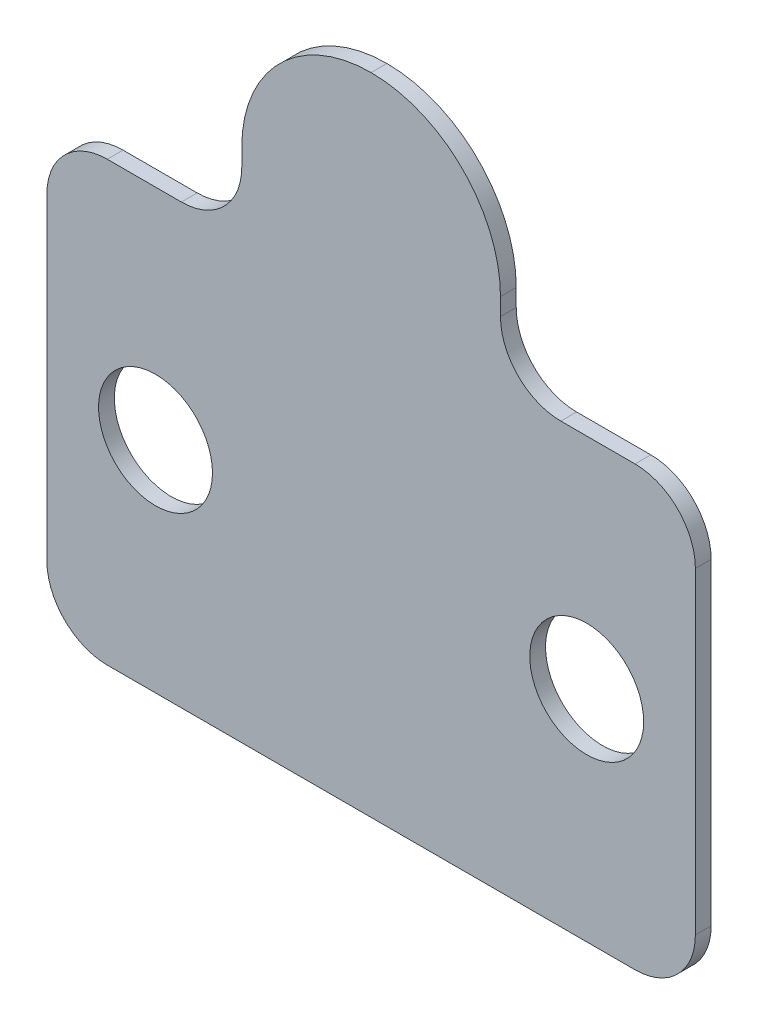
ISO-10303-21;
HEADER;
FILE_DESCRIPTION(('STEP AP214'),'2;1');
FILE_NAME('part.step','',(''),(''),'','','');
FILE_SCHEMA(('AUTOMOTIVE_DESIGN { 1 0 10303 214 1 1 1 1 }'));
ENDSEC;
DATA;
#1=APPLICATION_CONTEXT('core data for automotive mechanical design processes');
#2=APPLICATION_PROTOCOL_DEFINITION('international standard','automotive_design',2000,#1);
#3=PRODUCT_CONTEXT('',#1,'mechanical');
#4=PRODUCT('Part','Part','',(#3));
#5=PRODUCT_RELATED_PRODUCT_CATEGORY('part','',(#4));
#6=PRODUCT_DEFINITION_FORMATION('','',#4);
#7=PRODUCT_DEFINITION_CONTEXT('part definition',#1,'design');
#8=PRODUCT_DEFINITION('design','',#6,#7);
#9=PRODUCT_DEFINITION_SHAPE('','',#8);
#10=(LENGTH_UNIT() NAMED_UNIT(*) SI_UNIT(.MILLI.,.METRE.));
#11=(NAMED_UNIT(*) PLANE_ANGLE_UNIT() SI_UNIT($,.RADIAN.));
#12=(NAMED_UNIT(*) SI_UNIT($,.STERADIAN.) SOLID_ANGLE_UNIT());
#13=UNCERTAINTY_MEASURE_WITH_UNIT(LENGTH_MEASURE(1.E-05),#10,'distance_accuracy_value','');
#14=(GEOMETRIC_REPRESENTATION_CONTEXT(3) GLOBAL_UNCERTAINTY_ASSIGNED_CONTEXT((#13)) GLOBAL_UNIT_ASSIGNED_CONTEXT((#10,
#11,#12)) REPRESENTATION_CONTEXT('',''));
#15=CARTESIAN_POINT('',(0.,0.,0.));
#16=DIRECTION('',(0.,0.,1.));
#17=DIRECTION('',(1.,0.,0.));
#18=AXIS2_PLACEMENT_3D('',#15,#16,#17);
#19=CARTESIAN_POINT('',(0.,25.4,0.9144));
#20=DIRECTION('',(0.,1.,0.));
#21=DIRECTION('',(-1.,0.,0.));
#22=AXIS2_PLACEMENT_3D('',#19,#20,#21);
#23=PLANE('',#22);
#24=DIRECTION('',(1.,0.,0.));
#25=VECTOR('',#24,1.);
#26=CARTESIAN_POINT('',(0.,25.4,0.));
#27=LINE('',#26,#25);
#28=CARTESIAN_POINT('',(29.8,25.4,0.));
#29=VERTEX_POINT('',#28);
#30=CARTESIAN_POINT('',(34.1,25.4,0.));
#31=VERTEX_POINT('',#30);
#32=EDGE_CURVE('E359',#29,#31,#27,.T.);
#33=ORIENTED_EDGE('',*,*,#32,.F.);
#34=DIRECTION('',(0.,0.,-1.));
#35=VECTOR('',#34,1.);
#36=CARTESIAN_POINT('',(29.8,25.4,0.9144));
#37=LINE('',#36,#35);
#38=CARTESIAN_POINT('',(29.8,25.4,0.9144));
#39=VERTEX_POINT('',#38);
#40=EDGE_CURVE('E277',#29,#39,#37,.F.);
#41=ORIENTED_EDGE('',*,*,#40,.T.);
#42=DIRECTION('',(1.,0.,0.));
#43=VECTOR('',#42,1.);
#44=CARTESIAN_POINT('',(0.,25.4,0.9144));
#45=LINE('',#44,#43);
#46=CARTESIAN_POINT('',(34.1,25.4,0.9144));
#47=VERTEX_POINT('',#46);
#48=EDGE_CURVE('E440',#39,#47,#45,.T.);
#49=ORIENTED_EDGE('',*,*,#48,.T.);
#50=DIRECTION('',(0.,0.,-1.));
#51=VECTOR('',#50,1.);
#52=CARTESIAN_POINT('',(34.1,25.4,0.));
#53=LINE('',#52,#51);
#54=EDGE_CURVE('E273',#47,#31,#53,.T.);
#55=ORIENTED_EDGE('',*,*,#54,.T.);
#56=EDGE_LOOP('',(#33,#41,#49,#55));
#57=FACE_BOUND('',#56,.T.);
#58=ADVANCED_FACE('F45',(#57),#23,.T.);
#59=CARTESIAN_POINT('',(26.3,0.,0.9144));
#60=DIRECTION('',(1.,0.,0.));
#61=DIRECTION('',(0.,0.,-1.));
#62=AXIS2_PLACEMENT_3D('',#59,#60,#61);
#63=PLANE('',#62);
#64=DIRECTION('',(0.,-1.,0.));
#65=VECTOR('',#64,1.);
#66=CARTESIAN_POINT('',(26.3,0.,0.9144));
#67=LINE('',#66,#65);
#68=CARTESIAN_POINT('',(26.3,29.9,0.9144));
#69=VERTEX_POINT('',#68);
#70=CARTESIAN_POINT('',(26.3,28.9,0.9144));
#71=VERTEX_POINT('',#70);
#72=EDGE_CURVE('E345',#69,#71,#67,.T.);
#73=ORIENTED_EDGE('',*,*,#72,.T.);
#74=DIRECTION('',(0.,0.,-1.));
#75=VECTOR('',#74,1.);
#76=CARTESIAN_POINT('',(26.3,28.9,0.));
#77=LINE('',#76,#75);
#78=CARTESIAN_POINT('',(26.3,28.9,0.));
#79=VERTEX_POINT('',#78);
#80=EDGE_CURVE('E269',#71,#79,#77,.T.);
#81=ORIENTED_EDGE('',*,*,#80,.T.);
#82=DIRECTION('',(0.,-1.,0.));
#83=VECTOR('',#82,1.);
#84=CARTESIAN_POINT('',(26.3,0.,0.));
#85=LINE('',#84,#83);
#86=CARTESIAN_POINT('',(26.3,29.9,0.));
#87=VERTEX_POINT('',#86);
#88=EDGE_CURVE('E324',#87,#79,#85,.T.);
#89=ORIENTED_EDGE('',*,*,#88,.F.);
#90=DIRECTION('',(0.,0.,-1.));
#91=VECTOR('',#90,1.);
#92=CARTESIAN_POINT('',(26.3,29.9,0.9144));
#93=LINE('',#92,#91);
#94=EDGE_CURVE('E265',#87,#69,#93,.F.);
#95=ORIENTED_EDGE('',*,*,#94,.T.);
#96=EDGE_LOOP('',(#73,#81,#89,#95));
#97=FACE_BOUND('',#96,.T.);
#98=ADVANCED_FACE('F390',(#97),#63,.T.);
#99=CARTESIAN_POINT('',(11.3,0.,0.9144));
#100=DIRECTION('',(-1.,0.,0.));
#101=DIRECTION('',(0.,0.,1.));
#102=AXIS2_PLACEMENT_3D('',#99,#100,#101);
#103=PLANE('',#102);
#104=DIRECTION('',(0.,1.,0.));
#105=VECTOR('',#104,1.);
#106=CARTESIAN_POINT('',(11.3,0.,0.));
#107=LINE('',#106,#105);
#108=CARTESIAN_POINT('',(11.3,28.9,0.));
#109=VERTEX_POINT('',#108);
#110=CARTESIAN_POINT('',(11.3,29.9,0.));
#111=VERTEX_POINT('',#110);
#112=EDGE_CURVE('E311',#109,#111,#107,.T.);
#113=ORIENTED_EDGE('',*,*,#112,.F.);
#114=DIRECTION('',(0.,0.,-1.));
#115=VECTOR('',#114,1.);
#116=CARTESIAN_POINT('',(11.3,28.9,0.9144));
#117=LINE('',#116,#115);
#118=CARTESIAN_POINT('',(11.3,28.9,0.9144));
#119=VERTEX_POINT('',#118);
#120=EDGE_CURVE('E296',#109,#119,#117,.F.);
#121=ORIENTED_EDGE('',*,*,#120,.T.);
#122=DIRECTION('',(0.,1.,0.));
#123=VECTOR('',#122,1.);
#124=CARTESIAN_POINT('',(11.3,0.,0.9144));
#125=LINE('',#124,#123);
#126=CARTESIAN_POINT('',(11.3,29.9,0.9144));
#127=VERTEX_POINT('',#126);
#128=EDGE_CURVE('E332',#119,#127,#125,.T.);
#129=ORIENTED_EDGE('',*,*,#128,.T.);
#130=DIRECTION('',(0.,0.,-1.));
#131=VECTOR('',#130,1.);
#132=CARTESIAN_POINT('',(11.3,29.9,0.9144));
#133=LINE('',#132,#131);
#134=EDGE_CURVE('E293',#127,#111,#133,.T.);
#135=ORIENTED_EDGE('',*,*,#134,.T.);
#136=EDGE_LOOP('',(#113,#121,#129,#135));
#137=FACE_BOUND('',#136,.T.);
#138=ADVANCED_FACE('F319',(#137),#103,.T.);
#139=CARTESIAN_POINT('',(0.,25.4,0.9144));
#140=DIRECTION('',(0.,1.,0.));
#141=DIRECTION('',(0.,0.,1.));
#142=AXIS2_PLACEMENT_3D('',#139,#140,#141);
#143=PLANE('',#142);
#144=DIRECTION('',(1.,0.,0.));
#145=VECTOR('',#144,1.);
#146=CARTESIAN_POINT('',(0.,25.4,0.));
#147=LINE('',#146,#145);
#148=CARTESIAN_POINT('',(3.5,25.4,0.));
#149=VERTEX_POINT('',#148);
#150=CARTESIAN_POINT('',(7.8,25.4,0.));
#151=VERTEX_POINT('',#150);
#152=EDGE_CURVE('E314',#149,#151,#147,.T.);
#153=ORIENTED_EDGE('',*,*,#152,.F.);
#154=DIRECTION('',(0.,0.,-1.));
#155=VECTOR('',#154,1.);
#156=CARTESIAN_POINT('',(3.5,25.4,0.9144));
#157=LINE('',#156,#155);
#158=CARTESIAN_POINT('',(3.5,25.4,0.9144));
#159=VERTEX_POINT('',#158);
#160=EDGE_CURVE('E290',#149,#159,#157,.F.);
#161=ORIENTED_EDGE('',*,*,#160,.T.);
#162=DIRECTION('',(1.,0.,0.));
#163=VECTOR('',#162,1.);
#164=CARTESIAN_POINT('',(0.,25.4,0.9144));
#165=LINE('',#164,#163);
#166=CARTESIAN_POINT('',(7.8,25.4,0.9144));
#167=VERTEX_POINT('',#166);
#168=EDGE_CURVE('E331',#159,#167,#165,.T.);
#169=ORIENTED_EDGE('',*,*,#168,.T.);
#170=DIRECTION('',(0.,0.,-1.));
#171=VECTOR('',#170,1.);
#172=CARTESIAN_POINT('',(7.8,25.4,0.));
#173=LINE('',#172,#171);
#174=EDGE_CURVE('E286',#167,#151,#173,.T.);
#175=ORIENTED_EDGE('',*,*,#174,.T.);
#176=EDGE_LOOP('',(#153,#161,#169,#175));
#177=FACE_BOUND('',#176,.T.);
#178=ADVANCED_FACE('F334',(#177),#143,.T.);
#179=CARTESIAN_POINT('',(0.,0.,0.9144));
#180=DIRECTION('',(-1.,0.,0.));
#181=DIRECTION('',(0.,0.,1.));
#182=AXIS2_PLACEMENT_3D('',#179,#180,#181);
#183=PLANE('',#182);
#184=DIRECTION('',(0.,1.,0.));
#185=VECTOR('',#184,1.);
#186=CARTESIAN_POINT('',(0.,0.,0.));
#187=LINE('',#186,#185);
#188=CARTESIAN_POINT('',(0.,3.5,0.));
#189=VERTEX_POINT('',#188);
#190=CARTESIAN_POINT('',(0.,21.9,0.));
#191=VERTEX_POINT('',#190);
#192=EDGE_CURVE('E225',#189,#191,#187,.T.);
#193=ORIENTED_EDGE('',*,*,#192,.F.);
#194=DIRECTION('',(0.,0.,-1.));
#195=VECTOR('',#194,1.);
#196=CARTESIAN_POINT('',(0.,3.5,0.9144));
#197=LINE('',#196,#195);
#198=CARTESIAN_POINT('',(0.,3.5,0.9144));
#199=VERTEX_POINT('',#198);
#200=EDGE_CURVE('E74',#189,#199,#197,.F.);
#201=ORIENTED_EDGE('',*,*,#200,.T.);
#202=DIRECTION('',(0.,1.,0.));
#203=VECTOR('',#202,1.);
#204=CARTESIAN_POINT('',(0.,0.,0.9144));
#205=LINE('',#204,#203);
#206=CARTESIAN_POINT('',(0.,21.9,0.9144));
#207=VERTEX_POINT('',#206);
#208=EDGE_CURVE('E337',#199,#207,#205,.T.);
#209=ORIENTED_EDGE('',*,*,#208,.T.);
#210=DIRECTION('',(0.,0.,-1.));
#211=VECTOR('',#210,1.);
#212=CARTESIAN_POINT('',(0.,21.9,0.9144));
#213=LINE('',#212,#211);
#214=EDGE_CURVE('E280',#207,#191,#213,.T.);
#215=ORIENTED_EDGE('',*,*,#214,.T.);
#216=EDGE_LOOP('',(#193,#201,#209,#215));
#217=FACE_BOUND('',#216,.T.);
#218=ADVANCED_FACE('F368',(#217),#183,.T.);
#219=CARTESIAN_POINT('',(0.,0.,0.9144));
#220=DIRECTION('',(0.,1.,0.));
#221=DIRECTION('',(0.,0.,1.));
#222=AXIS2_PLACEMENT_3D('',#219,#220,#221);
#223=PLANE('',#222);
#224=DIRECTION('',(1.,0.,0.));
#225=VECTOR('',#224,1.);
#226=CARTESIAN_POINT('',(0.,0.,0.));
#227=LINE('',#226,#225);
#228=CARTESIAN_POINT('',(3.5,0.,0.));
#229=VERTEX_POINT('',#228);
#230=CARTESIAN_POINT('',(34.1,0.,0.));
#231=VERTEX_POINT('',#230);
#232=EDGE_CURVE('E215',#229,#231,#227,.T.);
#233=ORIENTED_EDGE('',*,*,#232,.T.);
#234=DIRECTION('',(0.,0.,-1.));
#235=VECTOR('',#234,1.);
#236=CARTESIAN_POINT('',(34.1,0.,0.9144));
#237=LINE('',#236,#235);
#238=CARTESIAN_POINT('',(34.1,0.,0.9144));
#239=VERTEX_POINT('',#238);
#240=EDGE_CURVE('E190',#231,#239,#237,.F.);
#241=ORIENTED_EDGE('',*,*,#240,.T.);
#242=DIRECTION('',(1.,0.,0.));
#243=VECTOR('',#242,1.);
#244=CARTESIAN_POINT('',(0.,0.,0.9144));
#245=LINE('',#244,#243);
#246=CARTESIAN_POINT('',(3.5,0.,0.9144));
#247=VERTEX_POINT('',#246);
#248=EDGE_CURVE('E342',#247,#239,#245,.T.);
#249=ORIENTED_EDGE('',*,*,#248,.F.);
#250=DIRECTION('',(0.,0.,-1.));
#251=VECTOR('',#250,1.);
#252=CARTESIAN_POINT('',(3.5,0.,0.));
#253=LINE('',#252,#251);
#254=EDGE_CURVE('E196',#247,#229,#253,.T.);
#255=ORIENTED_EDGE('',*,*,#254,.T.);
#256=EDGE_LOOP('',(#233,#241,#249,#255));
#257=FACE_BOUND('',#256,.T.);
#258=ADVANCED_FACE('F376',(#257),#223,.F.);
#259=CARTESIAN_POINT('',(6.3,12.7,0.9144));
#260=DIRECTION('',(0.,0.,-1.));
#261=DIRECTION('',(-1.,0.,0.));
#262=AXIS2_PLACEMENT_3D('',#259,#260,#261);
#263=CYLINDRICAL_SURFACE('',#262,3.302);
#264=CARTESIAN_POINT('',(6.3,12.7,0.9144));
#265=DIRECTION('',(0.,0.,1.));
#266=DIRECTION('',(1.,0.,0.));
#267=AXIS2_PLACEMENT_3D('',#264,#265,#266);
#268=CIRCLE('',#267,3.302);
#269=CARTESIAN_POINT('',(9.602,12.7,0.9144));
#270=VERTEX_POINT('',#269);
#271=EDGE_CURVE('E222',#270,#270,#268,.T.);
#272=ORIENTED_EDGE('',*,*,#271,.T.);
#273=EDGE_LOOP('',(#272));
#274=FACE_BOUND('',#273,.T.);
#275=CARTESIAN_POINT('',(6.3,12.7,0.));
#276=DIRECTION('',(0.,0.,1.));
#277=DIRECTION('',(1.,0.,0.));
#278=AXIS2_PLACEMENT_3D('',#275,#276,#277);
#279=CIRCLE('',#278,3.302);
#280=CARTESIAN_POINT('',(9.602,12.7,0.));
#281=VERTEX_POINT('',#280);
#282=EDGE_CURVE('E355',#281,#281,#279,.T.);
#283=ORIENTED_EDGE('',*,*,#282,.F.);
#284=EDGE_LOOP('',(#283));
#285=FACE_BOUND('',#284,.T.);
#286=ADVANCED_FACE('F378',(#274,#285),#263,.F.);
#287=CARTESIAN_POINT('',(31.3,12.7,0.9144));
#288=DIRECTION('',(0.,0.,-1.));
#289=DIRECTION('',(-1.,0.,0.));
#290=AXIS2_PLACEMENT_3D('',#287,#288,#289);
#291=CYLINDRICAL_SURFACE('',#290,3.30199999999998);
#292=CARTESIAN_POINT('',(31.3,12.7,0.9144));
#293=DIRECTION('',(0.,0.,1.));
#294=DIRECTION('',(1.,0.,0.));
#295=AXIS2_PLACEMENT_3D('',#292,#293,#294);
#296=CIRCLE('',#295,3.30199999999998);
#297=CARTESIAN_POINT('',(34.602,12.7,0.9144));
#298=VERTEX_POINT('',#297);
#299=EDGE_CURVE('E214',#298,#298,#296,.T.);
#300=ORIENTED_EDGE('',*,*,#299,.T.);
#301=EDGE_LOOP('',(#300));
#302=FACE_BOUND('',#301,.T.);
#303=CARTESIAN_POINT('',(31.3,12.7,0.));
#304=DIRECTION('',(0.,0.,1.));
#305=DIRECTION('',(1.,0.,0.));
#306=AXIS2_PLACEMENT_3D('',#303,#304,#305);
#307=CIRCLE('',#306,3.30199999999998);
#308=CARTESIAN_POINT('',(34.602,12.7,0.));
#309=VERTEX_POINT('',#308);
#310=EDGE_CURVE('E352',#309,#309,#307,.T.);
#311=ORIENTED_EDGE('',*,*,#310,.F.);
#312=EDGE_LOOP('',(#311));
#313=FACE_BOUND('',#312,.T.);
#314=ADVANCED_FACE('F384',(#302,#313),#291,.F.);
#315=CARTESIAN_POINT('',(37.6,0.,0.9144));
#316=DIRECTION('',(-1.,0.,0.));
#317=DIRECTION('',(0.,0.,1.));
#318=AXIS2_PLACEMENT_3D('',#315,#316,#317);
#319=PLANE('',#318);
#320=DIRECTION('',(0.,1.,0.));
#321=VECTOR('',#320,1.);
#322=CARTESIAN_POINT('',(37.6,0.,0.9144));
#323=LINE('',#322,#321);
#324=CARTESIAN_POINT('',(37.6,3.5,0.9144));
#325=VERTEX_POINT('',#324);
#326=CARTESIAN_POINT('',(37.6,21.9,0.9144));
#327=VERTEX_POINT('',#326);
#328=EDGE_CURVE('E206',#325,#327,#323,.T.);
#329=ORIENTED_EDGE('',*,*,#328,.F.);
#330=DIRECTION('',(0.,0.,-1.));
#331=VECTOR('',#330,1.);
#332=CARTESIAN_POINT('',(37.6,3.5,0.9144));
#333=LINE('',#332,#331);
#334=CARTESIAN_POINT('',(37.6,3.5,0.));
#335=VERTEX_POINT('',#334);
#336=EDGE_CURVE('E189',#325,#335,#333,.T.);
#337=ORIENTED_EDGE('',*,*,#336,.T.);
#338=DIRECTION('',(0.,1.,0.));
#339=VECTOR('',#338,1.);
#340=CARTESIAN_POINT('',(37.6,0.,0.));
#341=LINE('',#340,#339);
#342=CARTESIAN_POINT('',(37.6,21.9,0.));
#343=VERTEX_POINT('',#342);
#344=EDGE_CURVE('E203',#335,#343,#341,.T.);
#345=ORIENTED_EDGE('',*,*,#344,.T.);
#346=DIRECTION('',(0.,0.,-1.));
#347=VECTOR('',#346,1.);
#348=CARTESIAN_POINT('',(37.6,21.9,0.9144));
#349=LINE('',#348,#347);
#350=EDGE_CURVE('E209',#343,#327,#349,.F.);
#351=ORIENTED_EDGE('',*,*,#350,.T.);
#352=EDGE_LOOP('',(#329,#337,#345,#351));
#353=FACE_BOUND('',#352,.T.);
#354=ADVANCED_FACE('F202',(#353),#319,.F.);
#355=CARTESIAN_POINT('',(0.,0.,0.9144));
#356=DIRECTION('',(0.,0.,1.));
#357=DIRECTION('',(1.,0.,0.));
#358=AXIS2_PLACEMENT_3D('',#355,#356,#357);
#359=PLANE('',#358);
#360=ORIENTED_EDGE('',*,*,#299,.F.);
#361=EDGE_LOOP('',(#360));
#362=FACE_BOUND('',#361,.T.);
#363=ORIENTED_EDGE('',*,*,#271,.F.);
#364=EDGE_LOOP('',(#363));
#365=FACE_BOUND('',#364,.T.);
#366=ORIENTED_EDGE('',*,*,#248,.T.);
#367=CARTESIAN_POINT('',(34.1,3.5,0.9144));
#368=DIRECTION('',(0.,0.,1.));
#369=DIRECTION('',(1.,0.,0.));
#370=AXIS2_PLACEMENT_3D('',#367,#368,#369);
#371=CIRCLE('',#370,3.5);
#372=EDGE_CURVE('E262',#239,#325,#371,.T.);
#373=ORIENTED_EDGE('',*,*,#372,.T.);
#374=ORIENTED_EDGE('',*,*,#328,.T.);
#375=CARTESIAN_POINT('',(34.1,21.9,0.9144));
#376=DIRECTION('',(0.,0.,1.));
#377=DIRECTION('',(1.,0.,0.));
#378=AXIS2_PLACEMENT_3D('',#375,#376,#377);
#379=CIRCLE('',#378,3.5);
#380=EDGE_CURVE('E260',#327,#47,#379,.T.);
#381=ORIENTED_EDGE('',*,*,#380,.T.);
#382=ORIENTED_EDGE('',*,*,#48,.F.);
#383=CARTESIAN_POINT('',(29.8,28.9,0.9144));
#384=DIRECTION('',(0.,0.,1.));
#385=DIRECTION('',(1.,0.,0.));
#386=AXIS2_PLACEMENT_3D('',#383,#384,#385);
#387=CIRCLE('',#386,3.5);
#388=EDGE_CURVE('E302',#39,#71,#387,.F.);
#389=ORIENTED_EDGE('',*,*,#388,.T.);
#390=ORIENTED_EDGE('',*,*,#72,.F.);
#391=CARTESIAN_POINT('',(18.8,29.9,0.9144));
#392=DIRECTION('',(0.,0.,1.));
#393=DIRECTION('',(1.,0.,0.));
#394=AXIS2_PLACEMENT_3D('',#391,#392,#393);
#395=CIRCLE('',#394,7.5);
#396=CARTESIAN_POINT('',(18.8,37.4,0.9144));
#397=VERTEX_POINT('',#396);
#398=EDGE_CURVE('E252',#69,#397,#395,.T.);
#399=ORIENTED_EDGE('',*,*,#398,.T.);
#400=CARTESIAN_POINT('',(18.8,29.9,0.9144));
#401=DIRECTION('',(0.,0.,1.));
#402=DIRECTION('',(1.,0.,0.));
#403=AXIS2_PLACEMENT_3D('',#400,#401,#402);
#404=CIRCLE('',#403,7.5);
#405=EDGE_CURVE('E249',#397,#127,#404,.T.);
#406=ORIENTED_EDGE('',*,*,#405,.T.);
#407=ORIENTED_EDGE('',*,*,#128,.F.);
#408=CARTESIAN_POINT('',(7.8,28.9,0.9144));
#409=DIRECTION('',(0.,0.,1.));
#410=DIRECTION('',(1.,0.,0.));
#411=AXIS2_PLACEMENT_3D('',#408,#409,#410);
#412=CIRCLE('',#411,3.5);
#413=EDGE_CURVE('E12',#119,#167,#412,.F.);
#414=ORIENTED_EDGE('',*,*,#413,.T.);
#415=ORIENTED_EDGE('',*,*,#168,.F.);
#416=CARTESIAN_POINT('',(3.5,21.9,0.9144));
#417=DIRECTION('',(0.,0.,1.));
#418=DIRECTION('',(1.,0.,0.));
#419=AXIS2_PLACEMENT_3D('',#416,#417,#418);
#420=CIRCLE('',#419,3.5);
#421=EDGE_CURVE('E65',#159,#207,#420,.T.);
#422=ORIENTED_EDGE('',*,*,#421,.T.);
#423=ORIENTED_EDGE('',*,*,#208,.F.);
#424=CARTESIAN_POINT('',(3.5,3.5,0.9144));
#425=DIRECTION('',(0.,0.,1.));
#426=DIRECTION('',(1.,0.,0.));
#427=AXIS2_PLACEMENT_3D('',#424,#425,#426);
#428=CIRCLE('',#427,3.5);
#429=EDGE_CURVE('E257',#199,#247,#428,.T.);
#430=ORIENTED_EDGE('',*,*,#429,.T.);
#431=EDGE_LOOP('',(#366,#373,#374,#381,#382,#389,#390,#399,#406,#407,#414,#415,#422,#423,#430));
#432=FACE_BOUND('',#431,.T.);
#433=ADVANCED_FACE('F330',(#362,#365,#432),#359,.T.);
#434=CARTESIAN_POINT('',(0.,0.,0.));
#435=DIRECTION('',(0.,0.,1.));
#436=DIRECTION('',(1.,0.,0.));
#437=AXIS2_PLACEMENT_3D('',#434,#435,#436);
#438=PLANE('',#437);
#439=ORIENTED_EDGE('',*,*,#310,.T.);
#440=EDGE_LOOP('',(#439));
#441=FACE_BOUND('',#440,.T.);
#442=ORIENTED_EDGE('',*,*,#282,.T.);
#443=EDGE_LOOP('',(#442));
#444=FACE_BOUND('',#443,.T.);
#445=ORIENTED_EDGE('',*,*,#344,.F.);
#446=CARTESIAN_POINT('',(34.1,3.5,0.));
#447=DIRECTION('',(0.,0.,1.));
#448=DIRECTION('',(1.,0.,0.));
#449=AXIS2_PLACEMENT_3D('',#446,#447,#448);
#450=CIRCLE('',#449,3.5);
#451=EDGE_CURVE('E185',#335,#231,#450,.F.);
#452=ORIENTED_EDGE('',*,*,#451,.T.);
#453=ORIENTED_EDGE('',*,*,#232,.F.);
#454=CARTESIAN_POINT('',(3.5,3.5,0.));
#455=DIRECTION('',(0.,0.,1.));
#456=DIRECTION('',(1.,0.,0.));
#457=AXIS2_PLACEMENT_3D('',#454,#455,#456);
#458=CIRCLE('',#457,3.5);
#459=EDGE_CURVE('E239',#229,#189,#458,.F.);
#460=ORIENTED_EDGE('',*,*,#459,.T.);
#461=ORIENTED_EDGE('',*,*,#192,.T.);
#462=CARTESIAN_POINT('',(3.5,21.9,0.));
#463=DIRECTION('',(0.,0.,1.));
#464=DIRECTION('',(1.,0.,0.));
#465=AXIS2_PLACEMENT_3D('',#462,#463,#464);
#466=CIRCLE('',#465,3.5);
#467=EDGE_CURVE('E236',#191,#149,#466,.F.);
#468=ORIENTED_EDGE('',*,*,#467,.T.);
#469=ORIENTED_EDGE('',*,*,#152,.T.);
#470=CARTESIAN_POINT('',(7.8,28.9,0.));
#471=DIRECTION('',(0.,0.,1.));
#472=DIRECTION('',(1.,0.,0.));
#473=AXIS2_PLACEMENT_3D('',#470,#471,#472);
#474=CIRCLE('',#473,3.5);
#475=EDGE_CURVE('E55',#151,#109,#474,.T.);
#476=ORIENTED_EDGE('',*,*,#475,.T.);
#477=ORIENTED_EDGE('',*,*,#112,.T.);
#478=CARTESIAN_POINT('',(18.8,29.9,0.));
#479=DIRECTION('',(0.,0.,1.));
#480=DIRECTION('',(1.,0.,0.));
#481=AXIS2_PLACEMENT_3D('',#478,#479,#480);
#482=CIRCLE('',#481,7.5);
#483=CARTESIAN_POINT('',(18.8,37.4,0.));
#484=VERTEX_POINT('',#483);
#485=EDGE_CURVE('E208',#111,#484,#482,.F.);
#486=ORIENTED_EDGE('',*,*,#485,.T.);
#487=CARTESIAN_POINT('',(18.8,29.9,0.));
#488=DIRECTION('',(0.,0.,1.));
#489=DIRECTION('',(1.,0.,0.));
#490=AXIS2_PLACEMENT_3D('',#487,#488,#489);
#491=CIRCLE('',#490,7.5);
#492=EDGE_CURVE('E233',#484,#87,#491,.F.);
#493=ORIENTED_EDGE('',*,*,#492,.T.);
#494=ORIENTED_EDGE('',*,*,#88,.T.);
#495=CARTESIAN_POINT('',(29.8,28.9,0.));
#496=DIRECTION('',(0.,0.,1.));
#497=DIRECTION('',(1.,0.,0.));
#498=AXIS2_PLACEMENT_3D('',#495,#496,#497);
#499=CIRCLE('',#498,3.5);
#500=EDGE_CURVE('E299',#79,#29,#499,.T.);
#501=ORIENTED_EDGE('',*,*,#500,.T.);
#502=ORIENTED_EDGE('',*,*,#32,.T.);
#503=CARTESIAN_POINT('',(34.1,21.9,0.));
#504=DIRECTION('',(0.,0.,1.));
#505=DIRECTION('',(1.,0.,0.));
#506=AXIS2_PLACEMENT_3D('',#503,#504,#505);
#507=CIRCLE('',#506,3.5);
#508=EDGE_CURVE('E197',#31,#343,#507,.F.);
#509=ORIENTED_EDGE('',*,*,#508,.T.);
#510=EDGE_LOOP('',(#445,#452,#453,#460,#461,#468,#469,#476,#477,#486,#493,#494,#501,#502,#509));
#511=FACE_BOUND('',#510,.T.);
#512=ADVANCED_FACE('F211',(#441,#444,#511),#438,.F.);
#513=CARTESIAN_POINT('',(34.1,3.5,0.9144));
#514=DIRECTION('',(0.,0.,-1.));
#515=DIRECTION('',(-1.,0.,0.));
#516=AXIS2_PLACEMENT_3D('',#513,#514,#515);
#517=CYLINDRICAL_SURFACE('',#516,3.5);
#518=ORIENTED_EDGE('',*,*,#372,.F.);
#519=ORIENTED_EDGE('',*,*,#240,.F.);
#520=ORIENTED_EDGE('',*,*,#451,.F.);
#521=ORIENTED_EDGE('',*,*,#336,.F.);
#522=EDGE_LOOP('',(#518,#519,#520,#521));
#523=FACE_BOUND('',#522,.T.);
#524=ADVANCED_FACE('F188',(#523),#517,.T.);
#525=CARTESIAN_POINT('',(29.8,28.9,0.9144));
#526=DIRECTION('',(0.,0.,1.));
#527=DIRECTION('',(1.,0.,0.));
#528=AXIS2_PLACEMENT_3D('',#525,#526,#527);
#529=CYLINDRICAL_SURFACE('',#528,3.5);
#530=ORIENTED_EDGE('',*,*,#388,.F.);
#531=ORIENTED_EDGE('',*,*,#40,.F.);
#532=ORIENTED_EDGE('',*,*,#500,.F.);
#533=ORIENTED_EDGE('',*,*,#80,.F.);
#534=EDGE_LOOP('',(#530,#531,#532,#533));
#535=FACE_BOUND('',#534,.T.);
#536=ADVANCED_FACE('F406',(#535),#529,.F.);
#537=CARTESIAN_POINT('',(34.1,21.9,0.9144));
#538=DIRECTION('',(0.,0.,1.));
#539=DIRECTION('',(1.,0.,0.));
#540=AXIS2_PLACEMENT_3D('',#537,#538,#539);
#541=CYLINDRICAL_SURFACE('',#540,3.5);
#542=ORIENTED_EDGE('',*,*,#380,.F.);
#543=ORIENTED_EDGE('',*,*,#350,.F.);
#544=ORIENTED_EDGE('',*,*,#508,.F.);
#545=ORIENTED_EDGE('',*,*,#54,.F.);
#546=EDGE_LOOP('',(#542,#543,#544,#545));
#547=FACE_BOUND('',#546,.T.);
#548=ADVANCED_FACE('F409',(#547),#541,.T.);
#549=CARTESIAN_POINT('',(3.5,3.5,0.9144));
#550=DIRECTION('',(0.,0.,1.));
#551=DIRECTION('',(1.,0.,0.));
#552=AXIS2_PLACEMENT_3D('',#549,#550,#551);
#553=CYLINDRICAL_SURFACE('',#552,3.5);
#554=ORIENTED_EDGE('',*,*,#429,.F.);
#555=ORIENTED_EDGE('',*,*,#200,.F.);
#556=ORIENTED_EDGE('',*,*,#459,.F.);
#557=ORIENTED_EDGE('',*,*,#254,.F.);
#558=EDGE_LOOP('',(#554,#555,#556,#557));
#559=FACE_BOUND('',#558,.T.);
#560=ADVANCED_FACE('F372',(#559),#553,.T.);
#561=CARTESIAN_POINT('',(3.5,21.9,0.9144));
#562=DIRECTION('',(0.,0.,-1.));
#563=DIRECTION('',(-1.,0.,0.));
#564=AXIS2_PLACEMENT_3D('',#561,#562,#563);
#565=CYLINDRICAL_SURFACE('',#564,3.5);
#566=ORIENTED_EDGE('',*,*,#421,.F.);
#567=ORIENTED_EDGE('',*,*,#160,.F.);
#568=ORIENTED_EDGE('',*,*,#467,.F.);
#569=ORIENTED_EDGE('',*,*,#214,.F.);
#570=EDGE_LOOP('',(#566,#567,#568,#569));
#571=FACE_BOUND('',#570,.T.);
#572=ADVANCED_FACE('F416',(#571),#565,.T.);
#573=CARTESIAN_POINT('',(7.8,28.9,0.9144));
#574=DIRECTION('',(0.,0.,1.));
#575=DIRECTION('',(1.,0.,0.));
#576=AXIS2_PLACEMENT_3D('',#573,#574,#575);
#577=CYLINDRICAL_SURFACE('',#576,3.5);
#578=ORIENTED_EDGE('',*,*,#413,.F.);
#579=ORIENTED_EDGE('',*,*,#120,.F.);
#580=ORIENTED_EDGE('',*,*,#475,.F.);
#581=ORIENTED_EDGE('',*,*,#174,.F.);
#582=EDGE_LOOP('',(#578,#579,#580,#581));
#583=FACE_BOUND('',#582,.T.);
#584=ADVANCED_FACE('F327',(#583),#577,.F.);
#585=CARTESIAN_POINT('',(18.8,29.9,0.9144));
#586=DIRECTION('',(0.,0.,-1.));
#587=DIRECTION('',(-1.,0.,0.));
#588=AXIS2_PLACEMENT_3D('',#585,#586,#587);
#589=CYLINDRICAL_SURFACE('',#588,7.5);
#590=ORIENTED_EDGE('',*,*,#134,.F.);
#591=ORIENTED_EDGE('',*,*,#405,.F.);
#592=DIRECTION('',(0.,0.,-1.));
#593=VECTOR('',#592,1.);
#594=CARTESIAN_POINT('',(18.8,37.4,0.9144));
#595=LINE('',#594,#593);
#596=EDGE_CURVE('E49',#484,#397,#595,.F.);
#597=ORIENTED_EDGE('',*,*,#596,.F.);
#598=ORIENTED_EDGE('',*,*,#485,.F.);
#599=EDGE_LOOP('',(#590,#591,#597,#598));
#600=FACE_BOUND('',#599,.T.);
#601=ADVANCED_FACE('F47',(#600),#589,.T.);
#602=CARTESIAN_POINT('',(18.8,29.9,0.9144));
#603=DIRECTION('',(0.,0.,-1.));
#604=DIRECTION('',(-1.,0.,0.));
#605=AXIS2_PLACEMENT_3D('',#602,#603,#604);
#606=CYLINDRICAL_SURFACE('',#605,7.5);
#607=ORIENTED_EDGE('',*,*,#398,.F.);
#608=ORIENTED_EDGE('',*,*,#94,.F.);
#609=ORIENTED_EDGE('',*,*,#492,.F.);
#610=ORIENTED_EDGE('',*,*,#596,.T.);
#611=EDGE_LOOP('',(#607,#608,#609,#610));
#612=FACE_BOUND('',#611,.T.);
#613=ADVANCED_FACE('F421',(#612),#606,.T.);
#614=CLOSED_SHELL('',(#58,#98,#138,#178,#218,#258,#286,#314,#354,#433,#512,#524,#536,#548,#560,
#572,#584,#601,#613));
#615=MANIFOLD_SOLID_BREP('B2',#614);
#616=ADVANCED_BREP_SHAPE_REPRESENTATION('',(#18,#615),#14);
#617=SHAPE_DEFINITION_REPRESENTATION(#9,#616);
ENDSEC;
END-ISO-10303-21;
